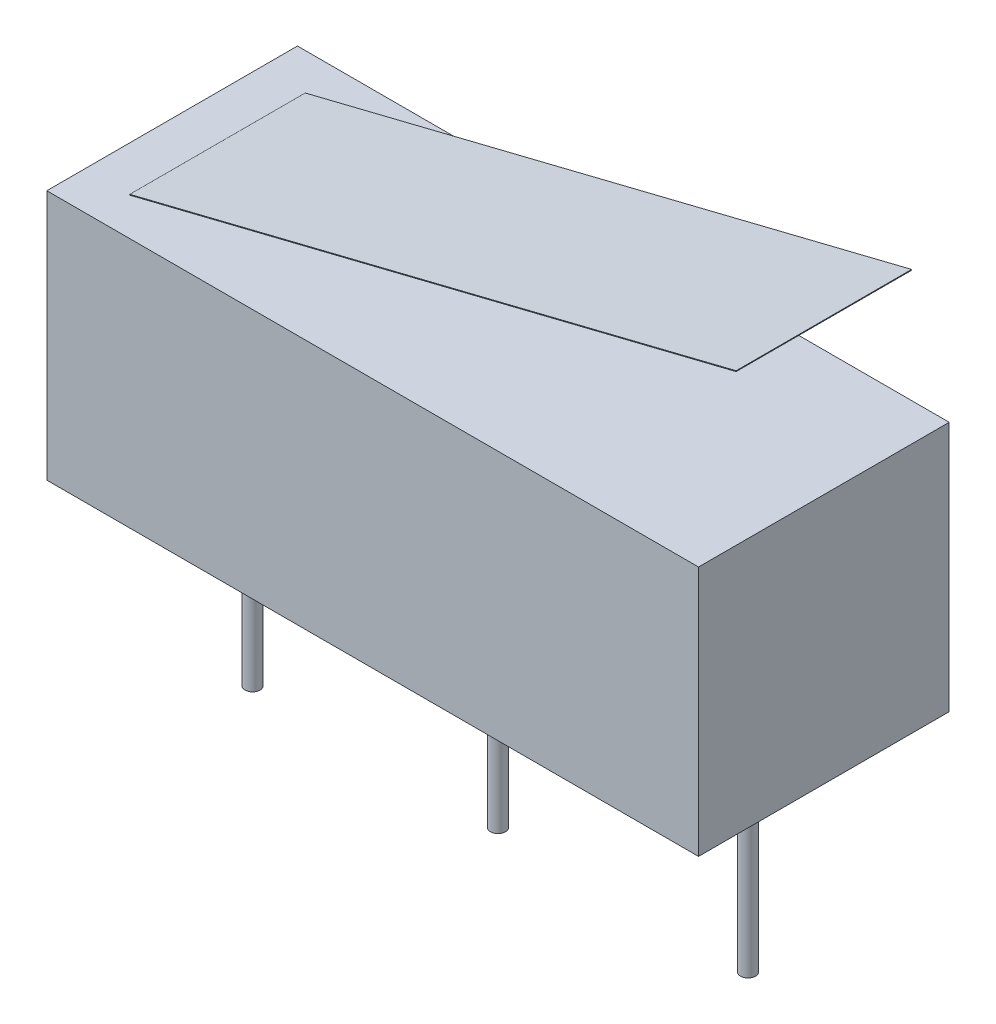
ISO-10303-21;
HEADER;
FILE_DESCRIPTION(('STEP AP214'),'2;1');
FILE_NAME('part.step','',(''),(''),'','','');
FILE_SCHEMA(('AUTOMOTIVE_DESIGN { 1 0 10303 214 1 1 1 1 }'));
ENDSEC;
DATA;
#1=APPLICATION_CONTEXT('core data for automotive mechanical design processes');
#2=APPLICATION_PROTOCOL_DEFINITION('international standard','automotive_design',2000,#1);
#3=PRODUCT_CONTEXT('',#1,'mechanical');
#4=PRODUCT('Part','Part','',(#3));
#5=PRODUCT_RELATED_PRODUCT_CATEGORY('part','',(#4));
#6=PRODUCT_DEFINITION_FORMATION('','',#4);
#7=PRODUCT_DEFINITION_CONTEXT('part definition',#1,'design');
#8=PRODUCT_DEFINITION('design','',#6,#7);
#9=PRODUCT_DEFINITION_SHAPE('','',#8);
#10=(LENGTH_UNIT() NAMED_UNIT(*) SI_UNIT(.MILLI.,.METRE.));
#11=(NAMED_UNIT(*) PLANE_ANGLE_UNIT() SI_UNIT($,.RADIAN.));
#12=(NAMED_UNIT(*) SI_UNIT($,.STERADIAN.) SOLID_ANGLE_UNIT());
#13=UNCERTAINTY_MEASURE_WITH_UNIT(LENGTH_MEASURE(1.E-05),#10,'distance_accuracy_value','');
#14=(GEOMETRIC_REPRESENTATION_CONTEXT(3) GLOBAL_UNCERTAINTY_ASSIGNED_CONTEXT((#13)) GLOBAL_UNIT_ASSIGNED_CONTEXT((#10,
#11,#12)) REPRESENTATION_CONTEXT('',''));
#15=CARTESIAN_POINT('',(0.,0.,0.));
#16=DIRECTION('',(0.,0.,1.));
#17=DIRECTION('',(1.,0.,0.));
#18=AXIS2_PLACEMENT_3D('',#15,#16,#17);
#19=CARTESIAN_POINT('',(6.5,9.,-1.75));
#20=DIRECTION('',(1.,0.,0.));
#21=DIRECTION('',(0.,0.,-1.));
#22=AXIS2_PLACEMENT_3D('',#19,#20,#21);
#23=PLANE('',#22);
#24=DIRECTION('',(0.,1.,0.));
#25=VECTOR('',#24,1.);
#26=CARTESIAN_POINT('',(6.5,9.,1.75));
#27=LINE('',#26,#25);
#28=CARTESIAN_POINT('',(6.5,9.,1.75));
#29=VERTEX_POINT('',#28);
#30=CARTESIAN_POINT('',(6.5,9.01553111279515,1.75));
#31=VERTEX_POINT('',#30);
#32=EDGE_CURVE('E108',#29,#31,#27,.T.);
#33=ORIENTED_EDGE('',*,*,#32,.F.);
#34=DIRECTION('',(0.,0.,1.));
#35=VECTOR('',#34,1.);
#36=CARTESIAN_POINT('',(6.5,9.,-1.75));
#37=LINE('',#36,#35);
#38=CARTESIAN_POINT('',(6.5,9.,-1.75));
#39=VERTEX_POINT('',#38);
#40=EDGE_CURVE('E12',#39,#29,#37,.T.);
#41=ORIENTED_EDGE('',*,*,#40,.F.);
#42=DIRECTION('',(0.,1.,0.));
#43=VECTOR('',#42,1.);
#44=CARTESIAN_POINT('',(6.5,9.,-1.75));
#45=LINE('',#44,#43);
#46=CARTESIAN_POINT('',(6.5,9.01553111279515,-1.75));
#47=VERTEX_POINT('',#46);
#48=EDGE_CURVE('E102',#39,#47,#45,.T.);
#49=ORIENTED_EDGE('',*,*,#48,.T.);
#50=DIRECTION('',(0.,0.,1.));
#51=VECTOR('',#50,1.);
#52=CARTESIAN_POINT('',(6.5,9.01553111279515,-1.75));
#53=LINE('',#52,#51);
#54=EDGE_CURVE('E47',#47,#31,#53,.T.);
#55=ORIENTED_EDGE('',*,*,#54,.T.);
#56=EDGE_LOOP('',(#33,#41,#49,#55));
#57=FACE_BOUND('',#56,.T.);
#58=ADVANCED_FACE('F44',(#57),#23,.T.);
#59=CARTESIAN_POINT('',(-5.59620157934415,6.,-1.75));
#60=DIRECTION('',(0.240718922300446,-0.970594869369559,0.));
#61=DIRECTION('',(0.970594869369559,0.240718922300446,0.));
#62=AXIS2_PLACEMENT_3D('',#59,#60,#61);
#63=PLANE('',#62);
#64=DIRECTION('',(0.970594869369559,0.240718922300446,0.));
#65=VECTOR('',#64,1.);
#66=CARTESIAN_POINT('',(-5.59620157934415,6.,1.75));
#67=LINE('',#66,#65);
#68=CARTESIAN_POINT('',(-5.59620157934415,6.,1.75));
#69=VERTEX_POINT('',#68);
#70=EDGE_CURVE('E104',#69,#29,#67,.T.);
#71=ORIENTED_EDGE('',*,*,#70,.F.);
#72=DIRECTION('',(0.,0.,1.));
#73=VECTOR('',#72,1.);
#74=CARTESIAN_POINT('',(-5.59620157934415,6.,-1.75));
#75=LINE('',#74,#73);
#76=CARTESIAN_POINT('',(-5.59620157934415,6.,-1.75));
#77=VERTEX_POINT('',#76);
#78=EDGE_CURVE('E53',#77,#69,#75,.T.);
#79=ORIENTED_EDGE('',*,*,#78,.F.);
#80=DIRECTION('',(0.970594869369559,0.240718922300446,0.));
#81=VECTOR('',#80,1.);
#82=CARTESIAN_POINT('',(-5.59620157934415,6.,-1.75));
#83=LINE('',#82,#81);
#84=EDGE_CURVE('E99',#77,#39,#83,.T.);
#85=ORIENTED_EDGE('',*,*,#84,.T.);
#86=ORIENTED_EDGE('',*,*,#40,.T.);
#87=EDGE_LOOP('',(#71,#79,#85,#86));
#88=FACE_BOUND('',#87,.T.);
#89=ADVANCED_FACE('F118',(#88),#63,.T.);
#90=CARTESIAN_POINT('',(-5.59620157934415,6.01553111279515,-1.75));
#91=DIRECTION('',(-1.,0.,0.));
#92=DIRECTION('',(0.,0.,1.));
#93=AXIS2_PLACEMENT_3D('',#90,#91,#92);
#94=PLANE('',#93);
#95=DIRECTION('',(0.,-1.,0.));
#96=VECTOR('',#95,1.);
#97=CARTESIAN_POINT('',(-5.59620157934415,6.01553111279515,1.75));
#98=LINE('',#97,#96);
#99=CARTESIAN_POINT('',(-5.59620157934415,6.01553111279515,1.75));
#100=VERTEX_POINT('',#99);
#101=EDGE_CURVE('E94',#100,#69,#98,.T.);
#102=ORIENTED_EDGE('',*,*,#101,.F.);
#103=DIRECTION('',(0.,0.,1.));
#104=VECTOR('',#103,1.);
#105=CARTESIAN_POINT('',(-5.59620157934415,6.01553111279515,-1.75));
#106=LINE('',#105,#104);
#107=CARTESIAN_POINT('',(-5.59620157934415,6.01553111279515,-1.75));
#108=VERTEX_POINT('',#107);
#109=EDGE_CURVE('E89',#108,#100,#106,.T.);
#110=ORIENTED_EDGE('',*,*,#109,.F.);
#111=DIRECTION('',(0.,-1.,0.));
#112=VECTOR('',#111,1.);
#113=CARTESIAN_POINT('',(-5.59620157934415,6.01553111279515,-1.75));
#114=LINE('',#113,#112);
#115=EDGE_CURVE('E92',#108,#77,#114,.T.);
#116=ORIENTED_EDGE('',*,*,#115,.T.);
#117=ORIENTED_EDGE('',*,*,#78,.T.);
#118=EDGE_LOOP('',(#102,#110,#116,#117));
#119=FACE_BOUND('',#118,.T.);
#120=ADVANCED_FACE('F91',(#119),#94,.T.);
#121=CARTESIAN_POINT('',(6.5,9.01553111279515,-1.75));
#122=DIRECTION('',(-0.240718922300446,0.970594869369559,0.));
#123=DIRECTION('',(-0.970594869369559,-0.240718922300446,0.));
#124=AXIS2_PLACEMENT_3D('',#121,#122,#123);
#125=PLANE('',#124);
#126=DIRECTION('',(-0.970594869369559,-0.240718922300446,0.));
#127=VECTOR('',#126,1.);
#128=CARTESIAN_POINT('',(6.5,9.01553111279515,1.75));
#129=LINE('',#128,#127);
#130=EDGE_CURVE('E111',#31,#100,#129,.T.);
#131=ORIENTED_EDGE('',*,*,#130,.F.);
#132=ORIENTED_EDGE('',*,*,#54,.F.);
#133=DIRECTION('',(-0.970594869369559,-0.240718922300446,0.));
#134=VECTOR('',#133,1.);
#135=CARTESIAN_POINT('',(6.5,9.01553111279515,-1.75));
#136=LINE('',#135,#134);
#137=EDGE_CURVE('E98',#47,#108,#136,.T.);
#138=ORIENTED_EDGE('',*,*,#137,.T.);
#139=ORIENTED_EDGE('',*,*,#109,.T.);
#140=EDGE_LOOP('',(#131,#132,#138,#139));
#141=FACE_BOUND('',#140,.T.);
#142=ADVANCED_FACE('F101',(#141),#125,.T.);
#143=CARTESIAN_POINT('',(0.,0.,-1.75));
#144=DIRECTION('',(0.,0.,1.));
#145=DIRECTION('',(1.,0.,0.));
#146=AXIS2_PLACEMENT_3D('',#143,#144,#145);
#147=PLANE('',#146);
#148=ORIENTED_EDGE('',*,*,#48,.F.);
#149=ORIENTED_EDGE('',*,*,#84,.F.);
#150=ORIENTED_EDGE('',*,*,#115,.F.);
#151=ORIENTED_EDGE('',*,*,#137,.F.);
#152=EDGE_LOOP('',(#148,#149,#150,#151));
#153=FACE_BOUND('',#152,.T.);
#154=ADVANCED_FACE('F97',(#153),#147,.F.);
#155=CARTESIAN_POINT('',(0.,0.,1.75));
#156=DIRECTION('',(0.,0.,1.));
#157=DIRECTION('',(1.,0.,0.));
#158=AXIS2_PLACEMENT_3D('',#155,#156,#157);
#159=PLANE('',#158);
#160=ORIENTED_EDGE('',*,*,#32,.T.);
#161=ORIENTED_EDGE('',*,*,#130,.T.);
#162=ORIENTED_EDGE('',*,*,#101,.T.);
#163=ORIENTED_EDGE('',*,*,#70,.T.);
#164=EDGE_LOOP('',(#160,#161,#162,#163));
#165=FACE_BOUND('',#164,.T.);
#166=ADVANCED_FACE('F117',(#165),#159,.T.);
#167=CLOSED_SHELL('',(#58,#89,#120,#142,#154,#166));
#168=MANIFOLD_SOLID_BREP('B2',#167);
#169=CARTESIAN_POINT('',(6.5,6.,-2.5));
#170=DIRECTION('',(-1.,0.,0.));
#171=DIRECTION('',(0.,0.,1.));
#172=AXIS2_PLACEMENT_3D('',#169,#170,#171);
#173=PLANE('',#172);
#174=DIRECTION('',(0.,0.,-1.));
#175=VECTOR('',#174,1.);
#176=CARTESIAN_POINT('',(6.5,1.,-2.5));
#177=LINE('',#176,#175);
#178=CARTESIAN_POINT('',(6.5,1.,2.5));
#179=VERTEX_POINT('',#178);
#180=CARTESIAN_POINT('',(6.5,1.,-2.5));
#181=VERTEX_POINT('',#180);
#182=EDGE_CURVE('E234',#179,#181,#177,.T.);
#183=ORIENTED_EDGE('',*,*,#182,.T.);
#184=DIRECTION('',(0.,-1.,0.));
#185=VECTOR('',#184,1.);
#186=CARTESIAN_POINT('',(6.5,6.,-2.5));
#187=LINE('',#186,#185);
#188=CARTESIAN_POINT('',(6.5,6.,-2.5));
#189=VERTEX_POINT('',#188);
#190=EDGE_CURVE('E225',#189,#181,#187,.T.);
#191=ORIENTED_EDGE('',*,*,#190,.F.);
#192=DIRECTION('',(0.,0.,-1.));
#193=VECTOR('',#192,1.);
#194=CARTESIAN_POINT('',(6.5,6.,-2.5));
#195=LINE('',#194,#193);
#196=CARTESIAN_POINT('',(6.5,6.,2.5));
#197=VERTEX_POINT('',#196);
#198=EDGE_CURVE('E219',#197,#189,#195,.T.);
#199=ORIENTED_EDGE('',*,*,#198,.F.);
#200=DIRECTION('',(0.,-1.,0.));
#201=VECTOR('',#200,1.);
#202=CARTESIAN_POINT('',(6.5,6.,2.5));
#203=LINE('',#202,#201);
#204=EDGE_CURVE('E230',#197,#179,#203,.T.);
#205=ORIENTED_EDGE('',*,*,#204,.T.);
#206=EDGE_LOOP('',(#183,#191,#199,#205));
#207=FACE_BOUND('',#206,.T.);
#208=ADVANCED_FACE('F167',(#207),#173,.F.);
#209=CARTESIAN_POINT('',(-6.5,6.,-2.5));
#210=DIRECTION('',(0.,0.,1.));
#211=DIRECTION('',(1.,0.,0.));
#212=AXIS2_PLACEMENT_3D('',#209,#210,#211);
#213=PLANE('',#212);
#214=DIRECTION('',(-1.,0.,0.));
#215=VECTOR('',#214,1.);
#216=CARTESIAN_POINT('',(-6.5,1.,-2.5));
#217=LINE('',#216,#215);
#218=CARTESIAN_POINT('',(-6.5,1.,-2.5));
#219=VERTEX_POINT('',#218);
#220=EDGE_CURVE('E224',#181,#219,#217,.T.);
#221=ORIENTED_EDGE('',*,*,#220,.T.);
#222=DIRECTION('',(0.,-1.,0.));
#223=VECTOR('',#222,1.);
#224=CARTESIAN_POINT('',(-6.5,6.,-2.5));
#225=LINE('',#224,#223);
#226=CARTESIAN_POINT('',(-6.5,6.,-2.5));
#227=VERTEX_POINT('',#226);
#228=EDGE_CURVE('E222',#227,#219,#225,.T.);
#229=ORIENTED_EDGE('',*,*,#228,.F.);
#230=DIRECTION('',(-1.,0.,0.));
#231=VECTOR('',#230,1.);
#232=CARTESIAN_POINT('',(-6.5,6.,-2.5));
#233=LINE('',#232,#231);
#234=EDGE_CURVE('E214',#189,#227,#233,.T.);
#235=ORIENTED_EDGE('',*,*,#234,.F.);
#236=ORIENTED_EDGE('',*,*,#190,.T.);
#237=EDGE_LOOP('',(#221,#229,#235,#236));
#238=FACE_BOUND('',#237,.T.);
#239=ADVANCED_FACE('F223',(#238),#213,.F.);
#240=CARTESIAN_POINT('',(-6.5,6.,-2.5));
#241=DIRECTION('',(1.,0.,0.));
#242=DIRECTION('',(0.,0.,-1.));
#243=AXIS2_PLACEMENT_3D('',#240,#241,#242);
#244=PLANE('',#243);
#245=DIRECTION('',(0.,0.,1.));
#246=VECTOR('',#245,1.);
#247=CARTESIAN_POINT('',(-6.5,1.,-2.5));
#248=LINE('',#247,#246);
#249=CARTESIAN_POINT('',(-6.5,1.,2.5));
#250=VERTEX_POINT('',#249);
#251=EDGE_CURVE('E200',#219,#250,#248,.T.);
#252=ORIENTED_EDGE('',*,*,#251,.T.);
#253=DIRECTION('',(0.,-1.,0.));
#254=VECTOR('',#253,1.);
#255=CARTESIAN_POINT('',(-6.5,6.,2.5));
#256=LINE('',#255,#254);
#257=CARTESIAN_POINT('',(-6.5,6.,2.5));
#258=VERTEX_POINT('',#257);
#259=EDGE_CURVE('E226',#258,#250,#256,.T.);
#260=ORIENTED_EDGE('',*,*,#259,.F.);
#261=DIRECTION('',(0.,0.,1.));
#262=VECTOR('',#261,1.);
#263=CARTESIAN_POINT('',(-6.5,6.,-2.5));
#264=LINE('',#263,#262);
#265=EDGE_CURVE('E217',#227,#258,#264,.T.);
#266=ORIENTED_EDGE('',*,*,#265,.F.);
#267=ORIENTED_EDGE('',*,*,#228,.T.);
#268=EDGE_LOOP('',(#252,#260,#266,#267));
#269=FACE_BOUND('',#268,.T.);
#270=ADVANCED_FACE('F228',(#269),#244,.F.);
#271=CARTESIAN_POINT('',(-6.5,6.,2.5));
#272=DIRECTION('',(0.,0.,-1.));
#273=DIRECTION('',(-1.,0.,0.));
#274=AXIS2_PLACEMENT_3D('',#271,#272,#273);
#275=PLANE('',#274);
#276=DIRECTION('',(1.,0.,0.));
#277=VECTOR('',#276,1.);
#278=CARTESIAN_POINT('',(-6.5,1.,2.5));
#279=LINE('',#278,#277);
#280=EDGE_CURVE('E206',#250,#179,#279,.T.);
#281=ORIENTED_EDGE('',*,*,#280,.T.);
#282=ORIENTED_EDGE('',*,*,#204,.F.);
#283=DIRECTION('',(1.,0.,0.));
#284=VECTOR('',#283,1.);
#285=CARTESIAN_POINT('',(-6.5,6.,2.5));
#286=LINE('',#285,#284);
#287=EDGE_CURVE('E183',#258,#197,#286,.T.);
#288=ORIENTED_EDGE('',*,*,#287,.F.);
#289=ORIENTED_EDGE('',*,*,#259,.T.);
#290=EDGE_LOOP('',(#281,#282,#288,#289));
#291=FACE_BOUND('',#290,.T.);
#292=ADVANCED_FACE('F261',(#291),#275,.F.);
#293=CARTESIAN_POINT('',(0.,6.,0.));
#294=DIRECTION('',(0.,1.,0.));
#295=DIRECTION('',(0.,0.,1.));
#296=AXIS2_PLACEMENT_3D('',#293,#294,#295);
#297=PLANE('',#296);
#298=ORIENTED_EDGE('',*,*,#198,.T.);
#299=ORIENTED_EDGE('',*,*,#234,.T.);
#300=ORIENTED_EDGE('',*,*,#265,.T.);
#301=ORIENTED_EDGE('',*,*,#287,.T.);
#302=EDGE_LOOP('',(#298,#299,#300,#301));
#303=FACE_BOUND('',#302,.T.);
#304=ADVANCED_FACE('F215',(#303),#297,.T.);
#305=CARTESIAN_POINT('',(0.,1.,0.));
#306=DIRECTION('',(0.,1.,0.));
#307=DIRECTION('',(0.,0.,1.));
#308=AXIS2_PLACEMENT_3D('',#305,#306,#307);
#309=PLANE('',#308);
#310=CARTESIAN_POINT('',(4.98803771985591,1.,0.));
#311=DIRECTION('',(0.,1.,0.));
#312=DIRECTION('',(0.,0.,1.));
#313=AXIS2_PLACEMENT_3D('',#310,#311,#312);
#314=CIRCLE('',#313,0.15);
#315=CARTESIAN_POINT('',(4.98803771985591,1.,0.15));
#316=VERTEX_POINT('',#315);
#317=EDGE_CURVE('E42',#316,#316,#314,.F.);
#318=ORIENTED_EDGE('',*,*,#317,.F.);
#319=EDGE_LOOP('',(#318));
#320=FACE_BOUND('',#319,.T.);
#321=CARTESIAN_POINT('',(-4.89651409196864,1.,0.));
#322=DIRECTION('',(0.,1.,0.));
#323=DIRECTION('',(0.,0.,1.));
#324=AXIS2_PLACEMENT_3D('',#321,#322,#323);
#325=CIRCLE('',#324,0.15);
#326=CARTESIAN_POINT('',(-4.89651409196864,1.,0.15));
#327=VERTEX_POINT('',#326);
#328=EDGE_CURVE('E175',#327,#327,#325,.F.);
#329=ORIENTED_EDGE('',*,*,#328,.F.);
#330=EDGE_LOOP('',(#329));
#331=FACE_BOUND('',#330,.T.);
#332=CARTESIAN_POINT('',(0.,1.,0.));
#333=DIRECTION('',(0.,1.,0.));
#334=DIRECTION('',(0.,0.,1.));
#335=AXIS2_PLACEMENT_3D('',#332,#333,#334);
#336=CIRCLE('',#335,0.15);
#337=CARTESIAN_POINT('',(0.,1.,0.15));
#338=VERTEX_POINT('',#337);
#339=EDGE_CURVE('E244',#338,#338,#336,.F.);
#340=ORIENTED_EDGE('',*,*,#339,.F.);
#341=EDGE_LOOP('',(#340));
#342=FACE_BOUND('',#341,.T.);
#343=ORIENTED_EDGE('',*,*,#182,.F.);
#344=ORIENTED_EDGE('',*,*,#280,.F.);
#345=ORIENTED_EDGE('',*,*,#251,.F.);
#346=ORIENTED_EDGE('',*,*,#220,.F.);
#347=EDGE_LOOP('',(#343,#344,#345,#346));
#348=FACE_BOUND('',#347,.T.);
#349=ADVANCED_FACE('F251',(#320,#331,#342,#348),#309,.F.);
#350=CARTESIAN_POINT('',(0.,-3.,0.));
#351=DIRECTION('',(0.,1.,0.));
#352=DIRECTION('',(0.,0.,1.));
#353=AXIS2_PLACEMENT_3D('',#350,#351,#352);
#354=CYLINDRICAL_SURFACE('',#353,0.15);
#355=CARTESIAN_POINT('',(0.,-3.,0.));
#356=DIRECTION('',(0.,-1.,0.));
#357=DIRECTION('',(0.,0.,-1.));
#358=AXIS2_PLACEMENT_3D('',#355,#356,#357);
#359=CIRCLE('',#358,0.15);
#360=CARTESIAN_POINT('',(0.,-3.,-0.15));
#361=VERTEX_POINT('',#360);
#362=EDGE_CURVE('E237',#361,#361,#359,.T.);
#363=ORIENTED_EDGE('',*,*,#362,.F.);
#364=EDGE_LOOP('',(#363));
#365=FACE_BOUND('',#364,.T.);
#366=ORIENTED_EDGE('',*,*,#339,.T.);
#367=EDGE_LOOP('',(#366));
#368=FACE_BOUND('',#367,.T.);
#369=ADVANCED_FACE('F254',(#365,#368),#354,.T.);
#370=CARTESIAN_POINT('',(0.,-3.,0.));
#371=DIRECTION('',(0.,-1.,0.));
#372=DIRECTION('',(0.,0.,-1.));
#373=AXIS2_PLACEMENT_3D('',#370,#371,#372);
#374=PLANE('',#373);
#375=ORIENTED_EDGE('',*,*,#362,.T.);
#376=EDGE_LOOP('',(#375));
#377=FACE_BOUND('',#376,.T.);
#378=ADVANCED_FACE('F305',(#377),#374,.T.);
#379=CARTESIAN_POINT('',(-4.89651409196864,-3.,0.));
#380=DIRECTION('',(0.,1.,0.));
#381=DIRECTION('',(0.,0.,1.));
#382=AXIS2_PLACEMENT_3D('',#379,#380,#381);
#383=CYLINDRICAL_SURFACE('',#382,0.15);
#384=CARTESIAN_POINT('',(-4.89651409196864,-3.,0.));
#385=DIRECTION('',(0.,-1.,0.));
#386=DIRECTION('',(0.,0.,-1.));
#387=AXIS2_PLACEMENT_3D('',#384,#385,#386);
#388=CIRCLE('',#387,0.15);
#389=CARTESIAN_POINT('',(-4.89651409196864,-3.,-0.15));
#390=VERTEX_POINT('',#389);
#391=EDGE_CURVE('E361',#390,#390,#388,.T.);
#392=ORIENTED_EDGE('',*,*,#391,.F.);
#393=EDGE_LOOP('',(#392));
#394=FACE_BOUND('',#393,.T.);
#395=ORIENTED_EDGE('',*,*,#328,.T.);
#396=EDGE_LOOP('',(#395));
#397=FACE_BOUND('',#396,.T.);
#398=ADVANCED_FACE('F249',(#394,#397),#383,.T.);
#399=CARTESIAN_POINT('',(-4.89651409196864,-3.,0.));
#400=DIRECTION('',(0.,-1.,0.));
#401=DIRECTION('',(0.,0.,-1.));
#402=AXIS2_PLACEMENT_3D('',#399,#400,#401);
#403=PLANE('',#402);
#404=ORIENTED_EDGE('',*,*,#391,.T.);
#405=EDGE_LOOP('',(#404));
#406=FACE_BOUND('',#405,.T.);
#407=ADVANCED_FACE('F324',(#406),#403,.T.);
#408=CARTESIAN_POINT('',(4.98803771985591,-3.,0.));
#409=DIRECTION('',(0.,1.,0.));
#410=DIRECTION('',(0.,0.,1.));
#411=AXIS2_PLACEMENT_3D('',#408,#409,#410);
#412=CYLINDRICAL_SURFACE('',#411,0.15);
#413=CARTESIAN_POINT('',(4.98803771985591,-3.,0.));
#414=DIRECTION('',(0.,-1.,0.));
#415=DIRECTION('',(0.,0.,-1.));
#416=AXIS2_PLACEMENT_3D('',#413,#414,#415);
#417=CIRCLE('',#416,0.15);
#418=CARTESIAN_POINT('',(4.98803771985591,-3.,-0.15));
#419=VERTEX_POINT('',#418);
#420=EDGE_CURVE('E360',#419,#419,#417,.T.);
#421=ORIENTED_EDGE('',*,*,#420,.F.);
#422=EDGE_LOOP('',(#421));
#423=FACE_BOUND('',#422,.T.);
#424=ORIENTED_EDGE('',*,*,#317,.T.);
#425=EDGE_LOOP('',(#424));
#426=FACE_BOUND('',#425,.T.);
#427=ADVANCED_FACE('F334',(#423,#426),#412,.T.);
#428=CARTESIAN_POINT('',(4.98803771985591,-3.,0.));
#429=DIRECTION('',(0.,-1.,0.));
#430=DIRECTION('',(0.,0.,-1.));
#431=AXIS2_PLACEMENT_3D('',#428,#429,#430);
#432=PLANE('',#431);
#433=ORIENTED_EDGE('',*,*,#420,.T.);
#434=EDGE_LOOP('',(#433));
#435=FACE_BOUND('',#434,.T.);
#436=ADVANCED_FACE('F344',(#435),#432,.T.);
#437=CLOSED_SHELL('',(#208,#239,#270,#292,#304,#349,#369,#378,#398,#407,#427,#436));
#438=MANIFOLD_SOLID_BREP('B6',#437);
#439=ADVANCED_BREP_SHAPE_REPRESENTATION('',(#18,#168,#438),#14);
#440=SHAPE_DEFINITION_REPRESENTATION(#9,#439);
ENDSEC;
END-ISO-10303-21;
